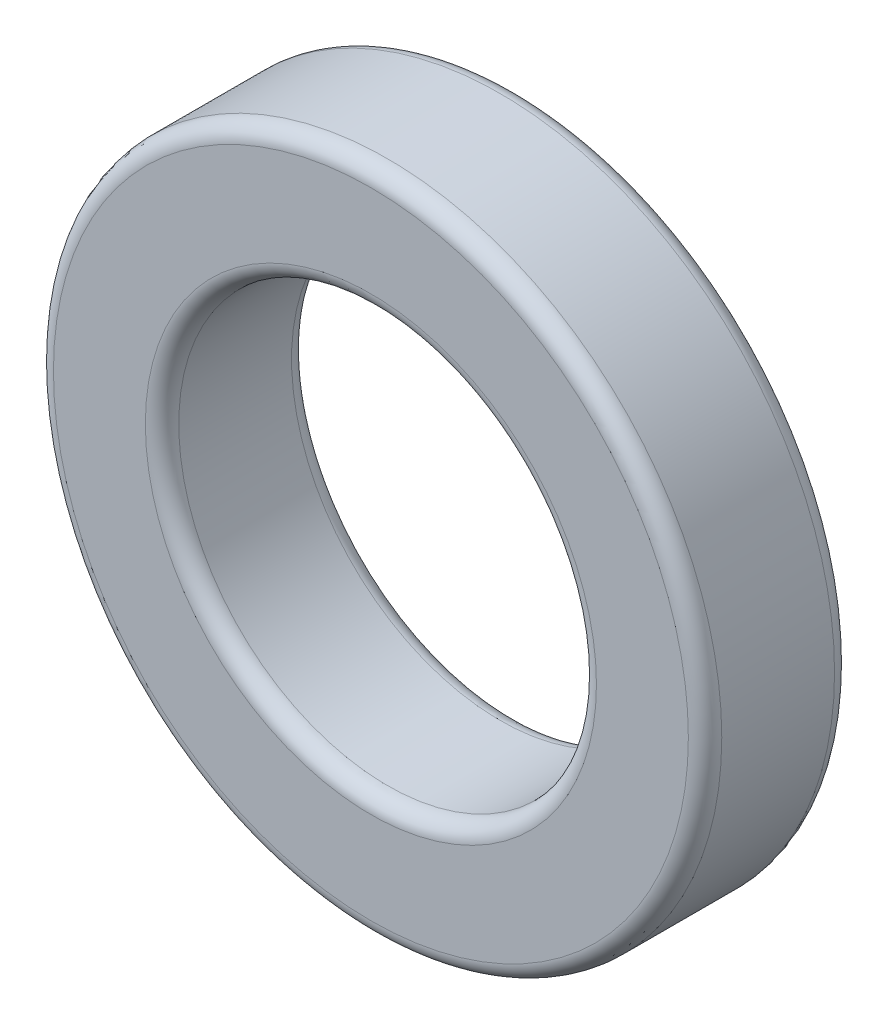
ISO-10303-21;
HEADER;
FILE_DESCRIPTION(('STEP AP214'),'2;1');
FILE_NAME('part.step','',(''),(''),'','','');
FILE_SCHEMA(('AUTOMOTIVE_DESIGN { 1 0 10303 214 1 1 1 1 }'));
ENDSEC;
DATA;
#1=APPLICATION_CONTEXT('core data for automotive mechanical design processes');
#2=APPLICATION_PROTOCOL_DEFINITION('international standard','automotive_design',2000,#1);
#3=PRODUCT_CONTEXT('',#1,'mechanical');
#4=PRODUCT('Part','Part','',(#3));
#5=PRODUCT_RELATED_PRODUCT_CATEGORY('part','',(#4));
#6=PRODUCT_DEFINITION_FORMATION('','',#4);
#7=PRODUCT_DEFINITION_CONTEXT('part definition',#1,'design');
#8=PRODUCT_DEFINITION('design','',#6,#7);
#9=PRODUCT_DEFINITION_SHAPE('','',#8);
#10=(LENGTH_UNIT() NAMED_UNIT(*) SI_UNIT(.MILLI.,.METRE.));
#11=(NAMED_UNIT(*) PLANE_ANGLE_UNIT() SI_UNIT($,.RADIAN.));
#12=(NAMED_UNIT(*) SI_UNIT($,.STERADIAN.) SOLID_ANGLE_UNIT());
#13=UNCERTAINTY_MEASURE_WITH_UNIT(LENGTH_MEASURE(1.E-05),#10,'distance_accuracy_value','');
#14=(GEOMETRIC_REPRESENTATION_CONTEXT(3) GLOBAL_UNCERTAINTY_ASSIGNED_CONTEXT((#13)) GLOBAL_UNIT_ASSIGNED_CONTEXT((#10,
#11,#12)) REPRESENTATION_CONTEXT('',''));
#15=CARTESIAN_POINT('',(0.,0.,0.));
#16=DIRECTION('',(0.,0.,1.));
#17=DIRECTION('',(1.,0.,0.));
#18=AXIS2_PLACEMENT_3D('',#15,#16,#17);
#19=CARTESIAN_POINT('',(0.,0.,7.));
#20=DIRECTION('',(0.,0.,1.));
#21=DIRECTION('',(1.,0.,0.));
#22=AXIS2_PLACEMENT_3D('',#19,#20,#21);
#23=PLANE('',#22);
#24=CARTESIAN_POINT('',(0.,0.,7.));
#25=DIRECTION('',(0.,0.,1.));
#26=DIRECTION('',(1.,0.,0.));
#27=AXIS2_PLACEMENT_3D('',#24,#25,#26);
#28=CIRCLE('',#27,10.8);
#29=CARTESIAN_POINT('',(10.8,0.,7.));
#30=VERTEX_POINT('',#29);
#31=EDGE_CURVE('E57',#30,#30,#28,.F.);
#32=ORIENTED_EDGE('',*,*,#31,.T.);
#33=EDGE_LOOP('',(#32));
#34=FACE_BOUND('',#33,.T.);
#35=CARTESIAN_POINT('',(0.,0.,7.));
#36=DIRECTION('',(0.,0.,1.));
#37=DIRECTION('',(1.,0.,0.));
#38=AXIS2_PLACEMENT_3D('',#35,#36,#37);
#39=CIRCLE('',#38,15.2);
#40=CARTESIAN_POINT('',(15.2,0.,7.));
#41=VERTEX_POINT('',#40);
#42=EDGE_CURVE('E60',#41,#41,#39,.T.);
#43=ORIENTED_EDGE('',*,*,#42,.T.);
#44=EDGE_LOOP('',(#43));
#45=FACE_BOUND('',#44,.T.);
#46=ADVANCED_FACE('F37',(#34,#45),#23,.T.);
#47=CARTESIAN_POINT('',(0.,0.,0.));
#48=DIRECTION('',(0.,0.,1.));
#49=DIRECTION('',(1.,0.,0.));
#50=AXIS2_PLACEMENT_3D('',#47,#48,#49);
#51=PLANE('',#50);
#52=CARTESIAN_POINT('',(0.,0.,0.));
#53=DIRECTION('',(0.,0.,1.));
#54=DIRECTION('',(1.,0.,0.));
#55=AXIS2_PLACEMENT_3D('',#52,#53,#54);
#56=CIRCLE('',#55,10.8);
#57=CARTESIAN_POINT('',(10.8,0.,0.));
#58=VERTEX_POINT('',#57);
#59=EDGE_CURVE('E48',#58,#58,#56,.T.);
#60=ORIENTED_EDGE('',*,*,#59,.T.);
#61=EDGE_LOOP('',(#60));
#62=FACE_BOUND('',#61,.T.);
#63=CARTESIAN_POINT('',(0.,0.,0.));
#64=DIRECTION('',(0.,0.,1.));
#65=DIRECTION('',(1.,0.,0.));
#66=AXIS2_PLACEMENT_3D('',#63,#64,#65);
#67=CIRCLE('',#66,15.2);
#68=CARTESIAN_POINT('',(15.2,0.,0.));
#69=VERTEX_POINT('',#68);
#70=EDGE_CURVE('E52',#69,#69,#67,.F.);
#71=ORIENTED_EDGE('',*,*,#70,.T.);
#72=EDGE_LOOP('',(#71));
#73=FACE_BOUND('',#72,.T.);
#74=ADVANCED_FACE('F80',(#62,#73),#51,.F.);
#75=CARTESIAN_POINT('',(0.,0.,7.));
#76=DIRECTION('',(0.,0.,-1.));
#77=DIRECTION('',(-1.,0.,0.));
#78=AXIS2_PLACEMENT_3D('',#75,#76,#77);
#79=CYLINDRICAL_SURFACE('',#78,16.);
#80=CARTESIAN_POINT('',(0.,0.,6.2));
#81=DIRECTION('',(0.,0.,1.));
#82=DIRECTION('',(1.,0.,0.));
#83=AXIS2_PLACEMENT_3D('',#80,#81,#82);
#84=CIRCLE('',#83,16.);
#85=CARTESIAN_POINT('',(16.,0.,6.2));
#86=VERTEX_POINT('',#85);
#87=EDGE_CURVE('E10',#86,#86,#84,.F.);
#88=ORIENTED_EDGE('',*,*,#87,.T.);
#89=EDGE_LOOP('',(#88));
#90=FACE_BOUND('',#89,.T.);
#91=CARTESIAN_POINT('',(0.,0.,0.8));
#92=DIRECTION('',(0.,0.,1.));
#93=DIRECTION('',(1.,0.,0.));
#94=AXIS2_PLACEMENT_3D('',#91,#92,#93);
#95=CIRCLE('',#94,16.);
#96=CARTESIAN_POINT('',(16.,0.,0.8));
#97=VERTEX_POINT('',#96);
#98=EDGE_CURVE('E44',#97,#97,#95,.T.);
#99=ORIENTED_EDGE('',*,*,#98,.T.);
#100=EDGE_LOOP('',(#99));
#101=FACE_BOUND('',#100,.T.);
#102=ADVANCED_FACE('F83',(#90,#101),#79,.T.);
#103=CARTESIAN_POINT('',(0.,0.,7.));
#104=DIRECTION('',(0.,0.,-1.));
#105=DIRECTION('',(-1.,0.,0.));
#106=AXIS2_PLACEMENT_3D('',#103,#104,#105);
#107=CYLINDRICAL_SURFACE('',#106,10.);
#108=CARTESIAN_POINT('',(0.,0.,6.2));
#109=DIRECTION('',(0.,0.,1.));
#110=DIRECTION('',(1.,0.,0.));
#111=AXIS2_PLACEMENT_3D('',#108,#109,#110);
#112=CIRCLE('',#111,10.);
#113=CARTESIAN_POINT('',(10.,0.,6.2));
#114=VERTEX_POINT('',#113);
#115=EDGE_CURVE('E63',#114,#114,#112,.T.);
#116=ORIENTED_EDGE('',*,*,#115,.T.);
#117=EDGE_LOOP('',(#116));
#118=FACE_BOUND('',#117,.T.);
#119=CARTESIAN_POINT('',(0.,0.,0.8));
#120=DIRECTION('',(0.,0.,1.));
#121=DIRECTION('',(1.,0.,0.));
#122=AXIS2_PLACEMENT_3D('',#119,#120,#121);
#123=CIRCLE('',#122,10.);
#124=CARTESIAN_POINT('',(10.,0.,0.8));
#125=VERTEX_POINT('',#124);
#126=EDGE_CURVE('E66',#125,#125,#123,.F.);
#127=ORIENTED_EDGE('',*,*,#126,.T.);
#128=EDGE_LOOP('',(#127));
#129=FACE_BOUND('',#128,.T.);
#130=ADVANCED_FACE('F70',(#118,#129),#107,.F.);
#131=CARTESIAN_POINT('',(0.,0.,6.2));
#132=DIRECTION('',(0.,0.,1.));
#133=DIRECTION('',(1.,0.,0.));
#134=AXIS2_PLACEMENT_3D('',#131,#132,#133);
#135=TOROIDAL_SURFACE('',#134,10.8,0.8);
#136=ORIENTED_EDGE('',*,*,#31,.F.);
#137=EDGE_LOOP('',(#136));
#138=FACE_BOUND('',#137,.T.);
#139=ORIENTED_EDGE('',*,*,#115,.F.);
#140=EDGE_LOOP('',(#139));
#141=FACE_BOUND('',#140,.T.);
#142=ADVANCED_FACE('F76',(#138,#141),#135,.T.);
#143=CARTESIAN_POINT('',(0.,0.,0.8));
#144=DIRECTION('',(0.,0.,1.));
#145=DIRECTION('',(1.,0.,0.));
#146=AXIS2_PLACEMENT_3D('',#143,#144,#145);
#147=TOROIDAL_SURFACE('',#146,10.8,0.8);
#148=ORIENTED_EDGE('',*,*,#126,.F.);
#149=EDGE_LOOP('',(#148));
#150=FACE_BOUND('',#149,.T.);
#151=ORIENTED_EDGE('',*,*,#59,.F.);
#152=EDGE_LOOP('',(#151));
#153=FACE_BOUND('',#152,.T.);
#154=ADVANCED_FACE('F72',(#150,#153),#147,.T.);
#155=CARTESIAN_POINT('',(0.,0.,6.2));
#156=DIRECTION('',(0.,0.,1.));
#157=DIRECTION('',(1.,0.,0.));
#158=AXIS2_PLACEMENT_3D('',#155,#156,#157);
#159=TOROIDAL_SURFACE('',#158,15.2,0.8);
#160=ORIENTED_EDGE('',*,*,#87,.F.);
#161=EDGE_LOOP('',(#160));
#162=FACE_BOUND('',#161,.T.);
#163=ORIENTED_EDGE('',*,*,#42,.F.);
#164=EDGE_LOOP('',(#163));
#165=FACE_BOUND('',#164,.T.);
#166=ADVANCED_FACE('F75',(#162,#165),#159,.T.);
#167=CARTESIAN_POINT('',(0.,0.,0.8));
#168=DIRECTION('',(0.,0.,1.));
#169=DIRECTION('',(1.,0.,0.));
#170=AXIS2_PLACEMENT_3D('',#167,#168,#169);
#171=TOROIDAL_SURFACE('',#170,15.2,0.8);
#172=ORIENTED_EDGE('',*,*,#70,.F.);
#173=EDGE_LOOP('',(#172));
#174=FACE_BOUND('',#173,.T.);
#175=ORIENTED_EDGE('',*,*,#98,.F.);
#176=EDGE_LOOP('',(#175));
#177=FACE_BOUND('',#176,.T.);
#178=ADVANCED_FACE('F39',(#174,#177),#171,.T.);
#179=CLOSED_SHELL('',(#46,#74,#102,#130,#142,#154,#166,#178));
#180=MANIFOLD_SOLID_BREP('B2',#179);
#181=ADVANCED_BREP_SHAPE_REPRESENTATION('',(#18,#180),#14);
#182=SHAPE_DEFINITION_REPRESENTATION(#9,#181);
ENDSEC;
END-ISO-10303-21;
